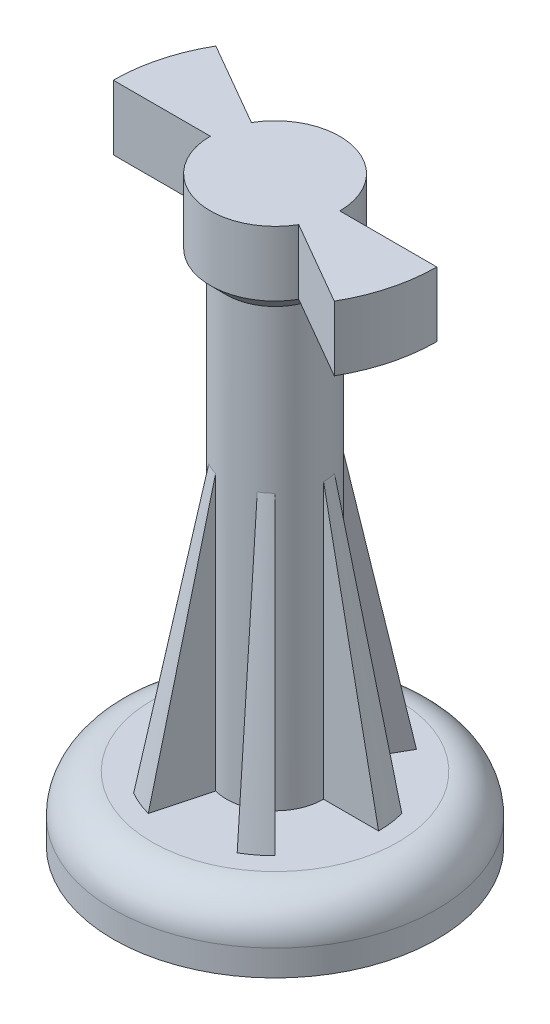
ISO-10303-21;
HEADER;
FILE_DESCRIPTION(('STEP AP214'),'2;1');
FILE_NAME('part.step','',(''),(''),'','','');
FILE_SCHEMA(('AUTOMOTIVE_DESIGN { 1 0 10303 214 1 1 1 1 }'));
ENDSEC;
DATA;
#1=APPLICATION_CONTEXT('core data for automotive mechanical design processes');
#2=APPLICATION_PROTOCOL_DEFINITION('international standard','automotive_design',2000,#1);
#3=PRODUCT_CONTEXT('',#1,'mechanical');
#4=PRODUCT('Part','Part','',(#3));
#5=PRODUCT_RELATED_PRODUCT_CATEGORY('part','',(#4));
#6=PRODUCT_DEFINITION_FORMATION('','',#4);
#7=PRODUCT_DEFINITION_CONTEXT('part definition',#1,'design');
#8=PRODUCT_DEFINITION('design','',#6,#7);
#9=PRODUCT_DEFINITION_SHAPE('','',#8);
#10=(LENGTH_UNIT() NAMED_UNIT(*) SI_UNIT(.MILLI.,.METRE.));
#11=(NAMED_UNIT(*) PLANE_ANGLE_UNIT() SI_UNIT($,.RADIAN.));
#12=(NAMED_UNIT(*) SI_UNIT($,.STERADIAN.) SOLID_ANGLE_UNIT());
#13=UNCERTAINTY_MEASURE_WITH_UNIT(LENGTH_MEASURE(1.E-05),#10,'distance_accuracy_value','');
#14=(GEOMETRIC_REPRESENTATION_CONTEXT(3) GLOBAL_UNCERTAINTY_ASSIGNED_CONTEXT((#13)) GLOBAL_UNIT_ASSIGNED_CONTEXT((#10,
#11,#12)) REPRESENTATION_CONTEXT('',''));
#15=CARTESIAN_POINT('',(0.,0.,0.));
#16=DIRECTION('',(0.,0.,1.));
#17=DIRECTION('',(1.,0.,0.));
#18=AXIS2_PLACEMENT_3D('',#15,#16,#17);
#19=CARTESIAN_POINT('',(0.,45.,0.));
#20=DIRECTION('',(0.,-1.,0.));
#21=DIRECTION('',(0.,0.,-1.));
#22=AXIS2_PLACEMENT_3D('',#19,#20,#21);
#23=CYLINDRICAL_SURFACE('',#22,3.75);
#24=CARTESIAN_POINT('',(0.,26.25,0.));
#25=DIRECTION('',(0.,-1.,0.));
#26=DIRECTION('',(0.,0.,-1.));
#27=AXIS2_PLACEMENT_3D('',#24,#25,#26);
#28=CIRCLE('',#27,3.75);
#29=CARTESIAN_POINT('',(1.87500000000004,26.25,3.24759526419162));
#30=VERTEX_POINT('',#29);
#31=CARTESIAN_POINT('',(2.65165042944959,26.25,2.65165042944952));
#32=VERTEX_POINT('',#31);
#33=EDGE_CURVE('E296',#30,#32,#28,.F.);
#34=ORIENTED_EDGE('',*,*,#33,.T.);
#35=DIRECTION('',(0.,-1.,0.));
#36=VECTOR('',#35,1.);
#37=CARTESIAN_POINT('',(2.65165042944959,45.,2.65165042944952));
#38=LINE('',#37,#36);
#39=CARTESIAN_POINT('',(2.65165042944959,5.,2.65165042944952));
#40=VERTEX_POINT('',#39);
#41=EDGE_CURVE('E424',#32,#40,#38,.T.);
#42=ORIENTED_EDGE('',*,*,#41,.T.);
#43=CARTESIAN_POINT('',(0.,5.,0.));
#44=DIRECTION('',(0.,1.,0.));
#45=DIRECTION('',(0.,0.,1.));
#46=AXIS2_PLACEMENT_3D('',#43,#44,#45);
#47=CIRCLE('',#46,3.75);
#48=CARTESIAN_POINT('',(3.75,5.,0.));
#49=VERTEX_POINT('',#48);
#50=EDGE_CURVE('E284',#40,#49,#47,.T.);
#51=ORIENTED_EDGE('',*,*,#50,.T.);
#52=DIRECTION('',(0.,-1.,0.));
#53=VECTOR('',#52,1.);
#54=CARTESIAN_POINT('',(3.75,45.,0.));
#55=LINE('',#54,#53);
#56=CARTESIAN_POINT('',(3.75,26.25,0.));
#57=VERTEX_POINT('',#56);
#58=EDGE_CURVE('E510',#57,#49,#55,.T.);
#59=ORIENTED_EDGE('',*,*,#58,.F.);
#60=CARTESIAN_POINT('',(0.,26.25,0.));
#61=DIRECTION('',(0.,-1.,0.));
#62=DIRECTION('',(0.,0.,-1.));
#63=AXIS2_PLACEMENT_3D('',#60,#61,#62);
#64=CIRCLE('',#63,3.75);
#65=CARTESIAN_POINT('',(3.62222184858401,26.25,-0.970571419134455));
#66=VERTEX_POINT('',#65);
#67=EDGE_CURVE('E282',#57,#66,#64,.F.);
#68=ORIENTED_EDGE('',*,*,#67,.T.);
#69=DIRECTION('',(0.,-1.,0.));
#70=VECTOR('',#69,1.);
#71=CARTESIAN_POINT('',(3.62222184858401,45.,-0.970571419134455));
#72=LINE('',#71,#70);
#73=CARTESIAN_POINT('',(3.62222184858401,5.,-0.970571419134455));
#74=VERTEX_POINT('',#73);
#75=EDGE_CURVE('E261',#66,#74,#72,.T.);
#76=ORIENTED_EDGE('',*,*,#75,.T.);
#77=CARTESIAN_POINT('',(1.87499999999999,5.,-3.24759526419165));
#78=VERTEX_POINT('',#77);
#79=EDGE_CURVE('E280',#74,#78,#47,.T.);
#80=ORIENTED_EDGE('',*,*,#79,.T.);
#81=DIRECTION('',(0.,-1.,0.));
#82=VECTOR('',#81,1.);
#83=CARTESIAN_POINT('',(1.87499999999999,45.,-3.24759526419165));
#84=LINE('',#83,#82);
#85=CARTESIAN_POINT('',(1.87499999999999,26.25,-3.24759526419165));
#86=VERTEX_POINT('',#85);
#87=EDGE_CURVE('E493',#86,#78,#84,.T.);
#88=ORIENTED_EDGE('',*,*,#87,.F.);
#89=CARTESIAN_POINT('',(0.,26.25,0.));
#90=DIRECTION('',(0.,-1.,0.));
#91=DIRECTION('',(0.,0.,-1.));
#92=AXIS2_PLACEMENT_3D('',#89,#90,#91);
#93=CIRCLE('',#92,3.75);
#94=CARTESIAN_POINT('',(0.970571419134442,26.25,-3.62222184858401));
#95=VERTEX_POINT('',#94);
#96=EDGE_CURVE('E288',#86,#95,#93,.F.);
#97=ORIENTED_EDGE('',*,*,#96,.T.);
#98=DIRECTION('',(0.,-1.,0.));
#99=VECTOR('',#98,1.);
#100=CARTESIAN_POINT('',(0.970571419134442,45.,-3.62222184858401));
#101=LINE('',#100,#99);
#102=CARTESIAN_POINT('',(0.970571419134442,5.,-3.62222184858401));
#103=VERTEX_POINT('',#102);
#104=EDGE_CURVE('E496',#95,#103,#101,.T.);
#105=ORIENTED_EDGE('',*,*,#104,.T.);
#106=CARTESIAN_POINT('',(-1.87500000000001,5.,-3.24759526419164));
#107=VERTEX_POINT('',#106);
#108=EDGE_CURVE('E283',#103,#107,#47,.T.);
#109=ORIENTED_EDGE('',*,*,#108,.T.);
#110=DIRECTION('',(0.,-1.,0.));
#111=VECTOR('',#110,1.);
#112=CARTESIAN_POINT('',(-1.87500000000002,45.,-3.24759526419164));
#113=LINE('',#112,#111);
#114=CARTESIAN_POINT('',(-1.87500000000002,26.25,-3.24759526419164));
#115=VERTEX_POINT('',#114);
#116=EDGE_CURVE('E475',#115,#107,#113,.T.);
#117=ORIENTED_EDGE('',*,*,#116,.F.);
#118=CARTESIAN_POINT('',(0.,26.25,0.));
#119=DIRECTION('',(0.,-1.,0.));
#120=DIRECTION('',(0.,0.,-1.));
#121=AXIS2_PLACEMENT_3D('',#118,#119,#120);
#122=CIRCLE('',#121,3.75);
#123=CARTESIAN_POINT('',(-2.65165042944957,26.25,-2.65165042944954));
#124=VERTEX_POINT('',#123);
#125=EDGE_CURVE('E290',#115,#124,#122,.F.);
#126=ORIENTED_EDGE('',*,*,#125,.T.);
#127=DIRECTION('',(0.,-1.,0.));
#128=VECTOR('',#127,1.);
#129=CARTESIAN_POINT('',(-2.65165042944957,45.,-2.65165042944954));
#130=LINE('',#129,#128);
#131=CARTESIAN_POINT('',(-2.65165042944957,5.,-2.65165042944954));
#132=VERTEX_POINT('',#131);
#133=EDGE_CURVE('E478',#124,#132,#130,.T.);
#134=ORIENTED_EDGE('',*,*,#133,.T.);
#135=CARTESIAN_POINT('',(-3.75,5.,0.));
#136=VERTEX_POINT('',#135);
#137=EDGE_CURVE('E884',#132,#136,#47,.T.);
#138=ORIENTED_EDGE('',*,*,#137,.T.);
#139=DIRECTION('',(0.,-1.,0.));
#140=VECTOR('',#139,1.);
#141=CARTESIAN_POINT('',(-3.75,45.,0.));
#142=LINE('',#141,#140);
#143=CARTESIAN_POINT('',(-3.75,26.25,0.));
#144=VERTEX_POINT('',#143);
#145=EDGE_CURVE('E457',#144,#136,#142,.T.);
#146=ORIENTED_EDGE('',*,*,#145,.F.);
#147=CARTESIAN_POINT('',(0.,26.25,0.));
#148=DIRECTION('',(0.,-1.,0.));
#149=DIRECTION('',(0.,0.,-1.));
#150=AXIS2_PLACEMENT_3D('',#147,#148,#149);
#151=CIRCLE('',#150,3.75);
#152=CARTESIAN_POINT('',(-3.62222184858401,26.25,0.970571419134455));
#153=VERTEX_POINT('',#152);
#154=EDGE_CURVE('E292',#144,#153,#151,.F.);
#155=ORIENTED_EDGE('',*,*,#154,.T.);
#156=DIRECTION('',(0.,-1.,0.));
#157=VECTOR('',#156,1.);
#158=CARTESIAN_POINT('',(-3.62222184858401,45.,0.970571419134455));
#159=LINE('',#158,#157);
#160=CARTESIAN_POINT('',(-3.62222184858401,5.,0.970571419134455));
#161=VERTEX_POINT('',#160);
#162=EDGE_CURVE('E460',#153,#161,#159,.T.);
#163=ORIENTED_EDGE('',*,*,#162,.T.);
#164=CARTESIAN_POINT('',(-1.87499999999997,5.,3.24759526419166));
#165=VERTEX_POINT('',#164);
#166=EDGE_CURVE('E883',#161,#165,#47,.T.);
#167=ORIENTED_EDGE('',*,*,#166,.T.);
#168=DIRECTION('',(0.,-1.,0.));
#169=VECTOR('',#168,1.);
#170=CARTESIAN_POINT('',(-1.87499999999997,45.,3.24759526419166));
#171=LINE('',#170,#169);
#172=CARTESIAN_POINT('',(-1.87499999999997,26.25,3.24759526419166));
#173=VERTEX_POINT('',#172);
#174=EDGE_CURVE('E439',#173,#165,#171,.T.);
#175=ORIENTED_EDGE('',*,*,#174,.F.);
#176=CARTESIAN_POINT('',(0.,26.25,0.));
#177=DIRECTION('',(0.,-1.,0.));
#178=DIRECTION('',(0.,0.,-1.));
#179=AXIS2_PLACEMENT_3D('',#176,#177,#178);
#180=CIRCLE('',#179,3.75);
#181=CARTESIAN_POINT('',(-0.970571419134417,26.25,3.62222184858402));
#182=VERTEX_POINT('',#181);
#183=EDGE_CURVE('E294',#173,#182,#180,.F.);
#184=ORIENTED_EDGE('',*,*,#183,.T.);
#185=DIRECTION('',(0.,-1.,0.));
#186=VECTOR('',#185,1.);
#187=CARTESIAN_POINT('',(-0.970571419134417,45.,3.62222184858402));
#188=LINE('',#187,#186);
#189=CARTESIAN_POINT('',(-0.970571419134417,5.,3.62222184858402));
#190=VERTEX_POINT('',#189);
#191=EDGE_CURVE('E442',#182,#190,#188,.T.);
#192=ORIENTED_EDGE('',*,*,#191,.T.);
#193=CARTESIAN_POINT('',(1.87500000000004,5.,3.24759526419162));
#194=VERTEX_POINT('',#193);
#195=EDGE_CURVE('E880',#190,#194,#47,.T.);
#196=ORIENTED_EDGE('',*,*,#195,.T.);
#197=DIRECTION('',(0.,-1.,0.));
#198=VECTOR('',#197,1.);
#199=CARTESIAN_POINT('',(1.87500000000004,45.,3.24759526419162));
#200=LINE('',#199,#198);
#201=EDGE_CURVE('E421',#30,#194,#200,.T.);
#202=ORIENTED_EDGE('',*,*,#201,.F.);
#203=EDGE_LOOP('',(#34,#42,#51,#59,#68,#76,#80,#88,#97,#105,#109,#117,#126,#134,#138,#146,#155,
#163,#167,#175,#184,#192,#196,#202));
#204=FACE_BOUND('',#203,.T.);
#205=CARTESIAN_POINT('',(0.,38.75,0.));
#206=DIRECTION('',(0.,1.,0.));
#207=DIRECTION('',(0.,0.,1.));
#208=AXIS2_PLACEMENT_3D('',#205,#206,#207);
#209=CIRCLE('',#208,3.75);
#210=CARTESIAN_POINT('',(0.,38.75,3.75));
#211=VERTEX_POINT('',#210);
#212=EDGE_CURVE('E11',#211,#211,#209,.T.);
#213=ORIENTED_EDGE('',*,*,#212,.F.);
#214=EDGE_LOOP('',(#213));
#215=FACE_BOUND('',#214,.T.);
#216=ADVANCED_FACE('F37',(#204,#215),#23,.T.);
#217=CARTESIAN_POINT('',(0.,5.,0.));
#218=DIRECTION('',(0.,-1.,0.));
#219=DIRECTION('',(0.,0.,-1.));
#220=AXIS2_PLACEMENT_3D('',#217,#218,#219);
#221=CYLINDRICAL_SURFACE('',#220,12.5);
#222=CARTESIAN_POINT('',(0.,2.,0.));
#223=DIRECTION('',(0.,1.,0.));
#224=DIRECTION('',(0.,0.,1.));
#225=AXIS2_PLACEMENT_3D('',#222,#223,#224);
#226=CIRCLE('',#225,12.5);
#227=CARTESIAN_POINT('',(0.,2.,12.5));
#228=VERTEX_POINT('',#227);
#229=EDGE_CURVE('E300',#228,#228,#226,.F.);
#230=ORIENTED_EDGE('',*,*,#229,.T.);
#231=EDGE_LOOP('',(#230));
#232=FACE_BOUND('',#231,.T.);
#233=CARTESIAN_POINT('',(0.,0.,0.));
#234=DIRECTION('',(0.,1.,0.));
#235=DIRECTION('',(0.,0.,1.));
#236=AXIS2_PLACEMENT_3D('',#233,#234,#235);
#237=CIRCLE('',#236,12.5);
#238=CARTESIAN_POINT('',(0.,0.,12.5));
#239=VERTEX_POINT('',#238);
#240=EDGE_CURVE('E275',#239,#239,#237,.T.);
#241=ORIENTED_EDGE('',*,*,#240,.T.);
#242=EDGE_LOOP('',(#241));
#243=FACE_BOUND('',#242,.T.);
#244=ADVANCED_FACE('F331',(#232,#243),#221,.T.);
#245=CARTESIAN_POINT('',(0.,5.,0.));
#246=DIRECTION('',(0.,1.,0.));
#247=DIRECTION('',(0.,0.,1.));
#248=AXIS2_PLACEMENT_3D('',#245,#246,#247);
#249=PLANE('',#248);
#250=CARTESIAN_POINT('',(0.,5.,0.));
#251=DIRECTION('',(0.,1.,0.));
#252=DIRECTION('',(0.,0.,1.));
#253=AXIS2_PLACEMENT_3D('',#250,#251,#252);
#254=CIRCLE('',#253,9.5);
#255=CARTESIAN_POINT('',(0.,5.,9.5));
#256=VERTEX_POINT('',#255);
#257=EDGE_CURVE('E298',#256,#256,#254,.T.);
#258=ORIENTED_EDGE('',*,*,#257,.T.);
#259=EDGE_LOOP('',(#258));
#260=FACE_BOUND('',#259,.T.);
#261=DIRECTION('',(0.707106781186556,0.,0.707106781186539));
#262=VECTOR('',#261,1.);
#263=CARTESIAN_POINT('',(5.65685424949245,5.00000000000001,5.65685424949231));
#264=LINE('',#263,#262);
#265=CARTESIAN_POINT('',(5.65685424949245,5.,5.65685424949231));
#266=VERTEX_POINT('',#265);
#267=EDGE_CURVE('E61',#40,#266,#264,.T.);
#268=ORIENTED_EDGE('',*,*,#267,.T.);
#269=CARTESIAN_POINT('',(0.,5.00000000000001,0.));
#270=DIRECTION('',(0.,-1.,0.));
#271=DIRECTION('',(0.866025403784433,0.,-0.50000000000001));
#272=AXIS2_PLACEMENT_3D('',#269,#270,#271);
#273=CIRCLE('',#272,8.);
#274=CARTESIAN_POINT('',(4.00000000000008,5.,6.92820323027546));
#275=VERTEX_POINT('',#274);
#276=EDGE_CURVE('E419',#266,#275,#273,.T.);
#277=ORIENTED_EDGE('',*,*,#276,.T.);
#278=DIRECTION('',(0.50000000000001,0.,0.866025403784433));
#279=VECTOR('',#278,1.);
#280=CARTESIAN_POINT('',(4.00000000000008,5.00000000000001,6.92820323027546));
#281=LINE('',#280,#279);
#282=EDGE_CURVE('E392',#194,#275,#281,.T.);
#283=ORIENTED_EDGE('',*,*,#282,.F.);
#284=ORIENTED_EDGE('',*,*,#195,.F.);
#285=DIRECTION('',(-0.258819045102511,0.,0.965925826289071));
#286=VECTOR('',#285,1.);
#287=CARTESIAN_POINT('',(-2.07055236082009,5.00000000000001,7.72740661031257));
#288=LINE('',#287,#286);
#289=CARTESIAN_POINT('',(-2.07055236082009,5.,7.72740661031257));
#290=VERTEX_POINT('',#289);
#291=EDGE_CURVE('E432',#190,#290,#288,.T.);
#292=ORIENTED_EDGE('',*,*,#291,.T.);
#293=CARTESIAN_POINT('',(0.,5.00000000000001,0.));
#294=DIRECTION('',(0.,-1.,0.));
#295=DIRECTION('',(0.866025403784443,0.,0.499999999999992));
#296=AXIS2_PLACEMENT_3D('',#293,#294,#295);
#297=CIRCLE('',#296,8.);
#298=CARTESIAN_POINT('',(-3.99999999999994,5.,6.92820323027555));
#299=VERTEX_POINT('',#298);
#300=EDGE_CURVE('E437',#290,#299,#297,.T.);
#301=ORIENTED_EDGE('',*,*,#300,.T.);
#302=DIRECTION('',(-0.499999999999992,0.,0.866025403784443));
#303=VECTOR('',#302,1.);
#304=CARTESIAN_POINT('',(-3.99999999999994,5.00000000000001,6.92820323027555));
#305=LINE('',#304,#303);
#306=EDGE_CURVE('E426',#165,#299,#305,.T.);
#307=ORIENTED_EDGE('',*,*,#306,.F.);
#308=ORIENTED_EDGE('',*,*,#166,.F.);
#309=DIRECTION('',(-0.965925826289068,0.,0.258819045102521));
#310=VECTOR('',#309,1.);
#311=CARTESIAN_POINT('',(-7.72740661031254,5.00000000000001,2.07055236082017));
#312=LINE('',#311,#310);
#313=CARTESIAN_POINT('',(-7.72740661031255,5.,2.07055236082017));
#314=VERTEX_POINT('',#313);
#315=EDGE_CURVE('E450',#161,#314,#312,.T.);
#316=ORIENTED_EDGE('',*,*,#315,.T.);
#317=CARTESIAN_POINT('',(0.,5.00000000000001,0.));
#318=DIRECTION('',(0.,-1.,0.));
#319=DIRECTION('',(0.,0.,1.));
#320=AXIS2_PLACEMENT_3D('',#317,#318,#319);
#321=CIRCLE('',#320,8.);
#322=CARTESIAN_POINT('',(-8.,5.,0.));
#323=VERTEX_POINT('',#322);
#324=EDGE_CURVE('E455',#314,#323,#321,.T.);
#325=ORIENTED_EDGE('',*,*,#324,.T.);
#326=DIRECTION('',(-1.,0.,0.));
#327=VECTOR('',#326,1.);
#328=CARTESIAN_POINT('',(-8.,5.00000000000001,0.));
#329=LINE('',#328,#327);
#330=EDGE_CURVE('E444',#136,#323,#329,.T.);
#331=ORIENTED_EDGE('',*,*,#330,.F.);
#332=ORIENTED_EDGE('',*,*,#137,.F.);
#333=DIRECTION('',(-0.707106781186551,0.,-0.707106781186544));
#334=VECTOR('',#333,1.);
#335=CARTESIAN_POINT('',(-5.65685424949241,5.00000000000001,-5.65685424949235));
#336=LINE('',#335,#334);
#337=CARTESIAN_POINT('',(-5.65685424949241,5.,-5.65685424949235));
#338=VERTEX_POINT('',#337);
#339=EDGE_CURVE('E468',#132,#338,#336,.T.);
#340=ORIENTED_EDGE('',*,*,#339,.T.);
#341=CARTESIAN_POINT('',(0.,5.00000000000001,0.));
#342=DIRECTION('',(0.,-1.,0.));
#343=DIRECTION('',(-0.866025403784436,0.,0.500000000000004));
#344=AXIS2_PLACEMENT_3D('',#341,#342,#343);
#345=CIRCLE('',#344,8.);
#346=CARTESIAN_POINT('',(-4.00000000000003,5.,-6.92820323027549));
#347=VERTEX_POINT('',#346);
#348=EDGE_CURVE('E473',#338,#347,#345,.T.);
#349=ORIENTED_EDGE('',*,*,#348,.T.);
#350=DIRECTION('',(-0.500000000000004,0.,-0.866025403784436));
#351=VECTOR('',#350,1.);
#352=CARTESIAN_POINT('',(-4.00000000000003,5.00000000000001,-6.92820323027549));
#353=LINE('',#352,#351);
#354=EDGE_CURVE('E462',#107,#347,#353,.T.);
#355=ORIENTED_EDGE('',*,*,#354,.F.);
#356=ORIENTED_EDGE('',*,*,#108,.F.);
#357=DIRECTION('',(0.258819045102518,0.,-0.965925826289069));
#358=VECTOR('',#357,1.);
#359=CARTESIAN_POINT('',(2.07055236082014,5.00000000000001,-7.72740661031255));
#360=LINE('',#359,#358);
#361=CARTESIAN_POINT('',(2.07055236082014,5.,-7.72740661031255));
#362=VERTEX_POINT('',#361);
#363=EDGE_CURVE('E486',#103,#362,#360,.T.);
#364=ORIENTED_EDGE('',*,*,#363,.T.);
#365=CARTESIAN_POINT('',(0.,5.00000000000001,0.));
#366=DIRECTION('',(0.,-1.,0.));
#367=DIRECTION('',(-0.86602540378444,0.,-0.499999999999998));
#368=AXIS2_PLACEMENT_3D('',#365,#366,#367);
#369=CIRCLE('',#368,8.);
#370=CARTESIAN_POINT('',(3.99999999999998,5.,-6.92820323027552));
#371=VERTEX_POINT('',#370);
#372=EDGE_CURVE('E491',#362,#371,#369,.T.);
#373=ORIENTED_EDGE('',*,*,#372,.T.);
#374=DIRECTION('',(0.499999999999998,0.,-0.86602540378444));
#375=VECTOR('',#374,1.);
#376=CARTESIAN_POINT('',(3.99999999999998,5.00000000000001,-6.92820323027552));
#377=LINE('',#376,#375);
#378=EDGE_CURVE('E480',#78,#371,#377,.T.);
#379=ORIENTED_EDGE('',*,*,#378,.F.);
#380=ORIENTED_EDGE('',*,*,#79,.F.);
#381=DIRECTION('',(0.965925826289068,0.,-0.258819045102521));
#382=VECTOR('',#381,1.);
#383=CARTESIAN_POINT('',(7.72740661031254,5.00000000000001,-2.07055236082017));
#384=LINE('',#383,#382);
#385=CARTESIAN_POINT('',(7.72740661031255,5.,-2.07055236082017));
#386=VERTEX_POINT('',#385);
#387=EDGE_CURVE('E504',#74,#386,#384,.T.);
#388=ORIENTED_EDGE('',*,*,#387,.T.);
#389=CARTESIAN_POINT('',(0.,5.00000000000001,0.));
#390=DIRECTION('',(0.,-1.,0.));
#391=DIRECTION('',(0.,0.,-1.));
#392=AXIS2_PLACEMENT_3D('',#389,#390,#391);
#393=CIRCLE('',#392,8.);
#394=CARTESIAN_POINT('',(8.,5.,0.));
#395=VERTEX_POINT('',#394);
#396=EDGE_CURVE('E509',#386,#395,#393,.T.);
#397=ORIENTED_EDGE('',*,*,#396,.T.);
#398=DIRECTION('',(1.,0.,0.));
#399=VECTOR('',#398,1.);
#400=CARTESIAN_POINT('',(8.,5.00000000000001,0.));
#401=LINE('',#400,#399);
#402=EDGE_CURVE('E498',#49,#395,#401,.T.);
#403=ORIENTED_EDGE('',*,*,#402,.F.);
#404=ORIENTED_EDGE('',*,*,#50,.F.);
#405=EDGE_LOOP('',(#268,#277,#283,#284,#292,#301,#307,#308,#316,#325,#331,#332,#340,#349,#355,
#356,#364,#373,#379,#380,#388,#397,#403,#404));
#406=FACE_BOUND('',#405,.T.);
#407=ADVANCED_FACE('F337',(#260,#406),#249,.T.);
#408=CARTESIAN_POINT('',(0.,0.,0.));
#409=DIRECTION('',(0.,1.,0.));
#410=DIRECTION('',(0.,0.,1.));
#411=AXIS2_PLACEMENT_3D('',#408,#409,#410);
#412=PLANE('',#411);
#413=ORIENTED_EDGE('',*,*,#240,.F.);
#414=EDGE_LOOP('',(#413));
#415=FACE_BOUND('',#414,.T.);
#416=ADVANCED_FACE('F344',(#415),#412,.F.);
#417=CARTESIAN_POINT('',(0.,5.00000000000001,0.));
#418=DIRECTION('',(0.,-1.,0.));
#419=DIRECTION('',(0.,0.,-1.));
#420=AXIS2_PLACEMENT_3D('',#417,#418,#419);
#421=CONICAL_SURFACE('',#420,8.,0.197395559849881);
#422=ORIENTED_EDGE('',*,*,#67,.F.);
#423=DIRECTION('',(-0.196116135138184,0.98058067569092,0.));
#424=VECTOR('',#423,1.);
#425=CARTESIAN_POINT('',(0.,45.,0.));
#426=LINE('',#425,#424);
#427=EDGE_CURVE('E501',#395,#57,#426,.T.);
#428=ORIENTED_EDGE('',*,*,#427,.F.);
#429=ORIENTED_EDGE('',*,*,#396,.F.);
#430=DIRECTION('',(-0.189433639881969,0.98058067569092,0.0507585908256618));
#431=VECTOR('',#430,1.);
#432=CARTESIAN_POINT('',(0.,45.,0.));
#433=LINE('',#432,#431);
#434=EDGE_CURVE('E506',#386,#66,#433,.T.);
#435=ORIENTED_EDGE('',*,*,#434,.T.);
#436=EDGE_LOOP('',(#422,#428,#429,#435));
#437=FACE_BOUND('',#436,.T.);
#438=ADVANCED_FACE('F347',(#437),#421,.T.);
#439=CARTESIAN_POINT('',(0.,0.,0.));
#440=DIRECTION('',(-0.258819045102521,0.,-0.965925826289068));
#441=DIRECTION('',(-0.965925826289068,0.,0.258819045102521));
#442=AXIS2_PLACEMENT_3D('',#439,#440,#441);
#443=PLANE('',#442);
#444=ORIENTED_EDGE('',*,*,#75,.F.);
#445=ORIENTED_EDGE('',*,*,#434,.F.);
#446=ORIENTED_EDGE('',*,*,#387,.F.);
#447=EDGE_LOOP('',(#444,#445,#446));
#448=FACE_BOUND('',#447,.T.);
#449=ADVANCED_FACE('F352',(#448),#443,.T.);
#450=CARTESIAN_POINT('',(0.,0.,0.));
#451=DIRECTION('',(0.,0.,-1.));
#452=DIRECTION('',(-1.,0.,0.));
#453=AXIS2_PLACEMENT_3D('',#450,#451,#452);
#454=PLANE('',#453);
#455=ORIENTED_EDGE('',*,*,#427,.T.);
#456=ORIENTED_EDGE('',*,*,#58,.T.);
#457=ORIENTED_EDGE('',*,*,#402,.T.);
#458=EDGE_LOOP('',(#455,#456,#457));
#459=FACE_BOUND('',#458,.T.);
#460=ADVANCED_FACE('F360',(#459),#454,.F.);
#461=CARTESIAN_POINT('',(0.,5.00000000000001,0.));
#462=DIRECTION('',(0.,-1.,0.));
#463=DIRECTION('',(-0.86602540378444,0.,-0.499999999999998));
#464=AXIS2_PLACEMENT_3D('',#461,#462,#463);
#465=CONICAL_SURFACE('',#464,8.,0.197395559849881);
#466=ORIENTED_EDGE('',*,*,#96,.F.);
#467=DIRECTION('',(-0.0980580675690916,0.98058067569092,0.16984155512169));
#468=VECTOR('',#467,1.);
#469=CARTESIAN_POINT('',(0.,45.,0.));
#470=LINE('',#469,#468);
#471=EDGE_CURVE('E483',#371,#86,#470,.T.);
#472=ORIENTED_EDGE('',*,*,#471,.F.);
#473=ORIENTED_EDGE('',*,*,#372,.F.);
#474=DIRECTION('',(-0.0507585908256612,0.98058067569092,0.189433639881969));
#475=VECTOR('',#474,1.);
#476=CARTESIAN_POINT('',(0.,45.,0.));
#477=LINE('',#476,#475);
#478=EDGE_CURVE('E488',#362,#95,#477,.T.);
#479=ORIENTED_EDGE('',*,*,#478,.T.);
#480=EDGE_LOOP('',(#466,#472,#473,#479));
#481=FACE_BOUND('',#480,.T.);
#482=ADVANCED_FACE('F522',(#481),#465,.T.);
#483=CARTESIAN_POINT('',(0.,0.,0.));
#484=DIRECTION('',(-0.965925826289069,0.,-0.258819045102518));
#485=DIRECTION('',(-0.258819045102518,0.,0.965925826289069));
#486=AXIS2_PLACEMENT_3D('',#483,#484,#485);
#487=PLANE('',#486);
#488=ORIENTED_EDGE('',*,*,#104,.F.);
#489=ORIENTED_EDGE('',*,*,#478,.F.);
#490=ORIENTED_EDGE('',*,*,#363,.F.);
#491=EDGE_LOOP('',(#488,#489,#490));
#492=FACE_BOUND('',#491,.T.);
#493=ADVANCED_FACE('F526',(#492),#487,.T.);
#494=CARTESIAN_POINT('',(0.,0.,0.));
#495=DIRECTION('',(-0.86602540378444,0.,-0.499999999999998));
#496=DIRECTION('',(-0.499999999999998,0.,0.86602540378444));
#497=AXIS2_PLACEMENT_3D('',#494,#495,#496);
#498=PLANE('',#497);
#499=ORIENTED_EDGE('',*,*,#471,.T.);
#500=ORIENTED_EDGE('',*,*,#87,.T.);
#501=ORIENTED_EDGE('',*,*,#378,.T.);
#502=EDGE_LOOP('',(#499,#500,#501));
#503=FACE_BOUND('',#502,.T.);
#504=ADVANCED_FACE('F532',(#503),#498,.F.);
#505=CARTESIAN_POINT('',(0.,5.00000000000001,0.));
#506=DIRECTION('',(0.,-1.,0.));
#507=DIRECTION('',(-0.866025403784436,0.,0.500000000000004));
#508=AXIS2_PLACEMENT_3D('',#505,#506,#507);
#509=CONICAL_SURFACE('',#508,8.,0.197395559849881);
#510=ORIENTED_EDGE('',*,*,#125,.F.);
#511=DIRECTION('',(0.0980580675690928,0.98058067569092,0.169841555121689));
#512=VECTOR('',#511,1.);
#513=CARTESIAN_POINT('',(0.,45.,0.));
#514=LINE('',#513,#512);
#515=EDGE_CURVE('E465',#347,#115,#514,.T.);
#516=ORIENTED_EDGE('',*,*,#515,.F.);
#517=ORIENTED_EDGE('',*,*,#348,.F.);
#518=DIRECTION('',(0.138675049056308,0.98058067569092,0.138675049056307));
#519=VECTOR('',#518,1.);
#520=CARTESIAN_POINT('',(0.,45.,0.));
#521=LINE('',#520,#519);
#522=EDGE_CURVE('E470',#338,#124,#521,.T.);
#523=ORIENTED_EDGE('',*,*,#522,.T.);
#524=EDGE_LOOP('',(#510,#516,#517,#523));
#525=FACE_BOUND('',#524,.T.);
#526=ADVANCED_FACE('F536',(#525),#509,.T.);
#527=CARTESIAN_POINT('',(0.,0.,0.));
#528=DIRECTION('',(-0.707106781186544,0.,0.707106781186551));
#529=DIRECTION('',(0.707106781186551,0.,0.707106781186544));
#530=AXIS2_PLACEMENT_3D('',#527,#528,#529);
#531=PLANE('',#530);
#532=ORIENTED_EDGE('',*,*,#133,.F.);
#533=ORIENTED_EDGE('',*,*,#522,.F.);
#534=ORIENTED_EDGE('',*,*,#339,.F.);
#535=EDGE_LOOP('',(#532,#533,#534));
#536=FACE_BOUND('',#535,.T.);
#537=ADVANCED_FACE('F540',(#536),#531,.T.);
#538=CARTESIAN_POINT('',(0.,0.,0.));
#539=DIRECTION('',(-0.866025403784436,0.,0.500000000000004));
#540=DIRECTION('',(0.500000000000004,0.,0.866025403784436));
#541=AXIS2_PLACEMENT_3D('',#538,#539,#540);
#542=PLANE('',#541);
#543=ORIENTED_EDGE('',*,*,#515,.T.);
#544=ORIENTED_EDGE('',*,*,#116,.T.);
#545=ORIENTED_EDGE('',*,*,#354,.T.);
#546=EDGE_LOOP('',(#543,#544,#545));
#547=FACE_BOUND('',#546,.T.);
#548=ADVANCED_FACE('F544',(#547),#542,.F.);
#549=CARTESIAN_POINT('',(0.,5.00000000000001,0.));
#550=DIRECTION('',(0.,-1.,0.));
#551=DIRECTION('',(0.,0.,1.));
#552=AXIS2_PLACEMENT_3D('',#549,#550,#551);
#553=CONICAL_SURFACE('',#552,8.,0.197395559849881);
#554=ORIENTED_EDGE('',*,*,#154,.F.);
#555=DIRECTION('',(0.196116135138184,0.98058067569092,0.));
#556=VECTOR('',#555,1.);
#557=CARTESIAN_POINT('',(0.,45.,0.));
#558=LINE('',#557,#556);
#559=EDGE_CURVE('E447',#323,#144,#558,.T.);
#560=ORIENTED_EDGE('',*,*,#559,.F.);
#561=ORIENTED_EDGE('',*,*,#324,.F.);
#562=DIRECTION('',(0.189433639881969,0.98058067569092,-0.0507585908256618));
#563=VECTOR('',#562,1.);
#564=CARTESIAN_POINT('',(0.,45.,0.));
#565=LINE('',#564,#563);
#566=EDGE_CURVE('E452',#314,#153,#565,.T.);
#567=ORIENTED_EDGE('',*,*,#566,.T.);
#568=EDGE_LOOP('',(#554,#560,#561,#567));
#569=FACE_BOUND('',#568,.T.);
#570=ADVANCED_FACE('F548',(#569),#553,.T.);
#571=CARTESIAN_POINT('',(0.,0.,0.));
#572=DIRECTION('',(0.258819045102521,0.,0.965925826289068));
#573=DIRECTION('',(0.965925826289068,0.,-0.258819045102521));
#574=AXIS2_PLACEMENT_3D('',#571,#572,#573);
#575=PLANE('',#574);
#576=ORIENTED_EDGE('',*,*,#162,.F.);
#577=ORIENTED_EDGE('',*,*,#566,.F.);
#578=ORIENTED_EDGE('',*,*,#315,.F.);
#579=EDGE_LOOP('',(#576,#577,#578));
#580=FACE_BOUND('',#579,.T.);
#581=ADVANCED_FACE('F552',(#580),#575,.T.);
#582=CARTESIAN_POINT('',(0.,0.,0.));
#583=DIRECTION('',(0.,0.,1.));
#584=DIRECTION('',(1.,0.,0.));
#585=AXIS2_PLACEMENT_3D('',#582,#583,#584);
#586=PLANE('',#585);
#587=ORIENTED_EDGE('',*,*,#559,.T.);
#588=ORIENTED_EDGE('',*,*,#145,.T.);
#589=ORIENTED_EDGE('',*,*,#330,.T.);
#590=EDGE_LOOP('',(#587,#588,#589));
#591=FACE_BOUND('',#590,.T.);
#592=ADVANCED_FACE('F556',(#591),#586,.F.);
#593=CARTESIAN_POINT('',(0.,5.00000000000001,0.));
#594=DIRECTION('',(0.,-1.,0.));
#595=DIRECTION('',(0.866025403784443,0.,0.499999999999992));
#596=AXIS2_PLACEMENT_3D('',#593,#594,#595);
#597=CONICAL_SURFACE('',#596,8.,0.197395559849881);
#598=ORIENTED_EDGE('',*,*,#183,.F.);
#599=DIRECTION('',(0.0980580675690904,0.98058067569092,-0.16984155512169));
#600=VECTOR('',#599,1.);
#601=CARTESIAN_POINT('',(0.,45.,0.));
#602=LINE('',#601,#600);
#603=EDGE_CURVE('E429',#299,#173,#602,.T.);
#604=ORIENTED_EDGE('',*,*,#603,.F.);
#605=ORIENTED_EDGE('',*,*,#300,.F.);
#606=DIRECTION('',(0.0507585908256598,0.98058067569092,-0.189433639881969));
#607=VECTOR('',#606,1.);
#608=CARTESIAN_POINT('',(0.,45.,0.));
#609=LINE('',#608,#607);
#610=EDGE_CURVE('E434',#290,#182,#609,.T.);
#611=ORIENTED_EDGE('',*,*,#610,.T.);
#612=EDGE_LOOP('',(#598,#604,#605,#611));
#613=FACE_BOUND('',#612,.T.);
#614=ADVANCED_FACE('F560',(#613),#597,.T.);
#615=CARTESIAN_POINT('',(0.,0.,0.));
#616=DIRECTION('',(0.965925826289071,0.,0.258819045102511));
#617=DIRECTION('',(0.258819045102511,0.,-0.965925826289071));
#618=AXIS2_PLACEMENT_3D('',#615,#616,#617);
#619=PLANE('',#618);
#620=ORIENTED_EDGE('',*,*,#191,.F.);
#621=ORIENTED_EDGE('',*,*,#610,.F.);
#622=ORIENTED_EDGE('',*,*,#291,.F.);
#623=EDGE_LOOP('',(#620,#621,#622));
#624=FACE_BOUND('',#623,.T.);
#625=ADVANCED_FACE('F564',(#624),#619,.T.);
#626=CARTESIAN_POINT('',(0.,0.,0.));
#627=DIRECTION('',(0.866025403784443,0.,0.499999999999992));
#628=DIRECTION('',(0.499999999999992,0.,-0.866025403784443));
#629=AXIS2_PLACEMENT_3D('',#626,#627,#628);
#630=PLANE('',#629);
#631=ORIENTED_EDGE('',*,*,#603,.T.);
#632=ORIENTED_EDGE('',*,*,#174,.T.);
#633=ORIENTED_EDGE('',*,*,#306,.T.);
#634=EDGE_LOOP('',(#631,#632,#633));
#635=FACE_BOUND('',#634,.T.);
#636=ADVANCED_FACE('F568',(#635),#630,.F.);
#637=CARTESIAN_POINT('',(0.,5.00000000000001,0.));
#638=DIRECTION('',(0.,-1.,0.));
#639=DIRECTION('',(0.866025403784433,0.,-0.50000000000001));
#640=AXIS2_PLACEMENT_3D('',#637,#638,#639);
#641=CONICAL_SURFACE('',#640,8.,0.197395559849881);
#642=ORIENTED_EDGE('',*,*,#33,.F.);
#643=DIRECTION('',(-0.098058067569094,0.98058067569092,-0.169841555121688));
#644=VECTOR('',#643,1.);
#645=CARTESIAN_POINT('',(0.,45.,0.));
#646=LINE('',#645,#644);
#647=EDGE_CURVE('E412',#275,#30,#646,.T.);
#648=ORIENTED_EDGE('',*,*,#647,.F.);
#649=ORIENTED_EDGE('',*,*,#276,.F.);
#650=DIRECTION('',(-0.138675049056309,0.98058067569092,-0.138675049056306));
#651=VECTOR('',#650,1.);
#652=CARTESIAN_POINT('',(0.,45.,0.));
#653=LINE('',#652,#651);
#654=EDGE_CURVE('E416',#266,#32,#653,.T.);
#655=ORIENTED_EDGE('',*,*,#654,.T.);
#656=EDGE_LOOP('',(#642,#648,#649,#655));
#657=FACE_BOUND('',#656,.T.);
#658=ADVANCED_FACE('F572',(#657),#641,.T.);
#659=CARTESIAN_POINT('',(0.,0.,0.));
#660=DIRECTION('',(0.707106781186539,0.,-0.707106781186556));
#661=DIRECTION('',(-0.707106781186556,0.,-0.707106781186539));
#662=AXIS2_PLACEMENT_3D('',#659,#660,#661);
#663=PLANE('',#662);
#664=ORIENTED_EDGE('',*,*,#41,.F.);
#665=ORIENTED_EDGE('',*,*,#654,.F.);
#666=ORIENTED_EDGE('',*,*,#267,.F.);
#667=EDGE_LOOP('',(#664,#665,#666));
#668=FACE_BOUND('',#667,.T.);
#669=ADVANCED_FACE('F576',(#668),#663,.T.);
#670=CARTESIAN_POINT('',(0.,0.,0.));
#671=DIRECTION('',(0.866025403784433,0.,-0.50000000000001));
#672=DIRECTION('',(-0.50000000000001,0.,-0.866025403784433));
#673=AXIS2_PLACEMENT_3D('',#670,#671,#672);
#674=PLANE('',#673);
#675=ORIENTED_EDGE('',*,*,#647,.T.);
#676=ORIENTED_EDGE('',*,*,#201,.T.);
#677=ORIENTED_EDGE('',*,*,#282,.T.);
#678=EDGE_LOOP('',(#675,#676,#677));
#679=FACE_BOUND('',#678,.T.);
#680=ADVANCED_FACE('F580',(#679),#674,.F.);
#681=CARTESIAN_POINT('',(0.,2.,0.));
#682=DIRECTION('',(0.,1.,0.));
#683=DIRECTION('',(0.,0.,1.));
#684=AXIS2_PLACEMENT_3D('',#681,#682,#683);
#685=TOROIDAL_SURFACE('',#684,9.5,3.);
#686=ORIENTED_EDGE('',*,*,#229,.F.);
#687=EDGE_LOOP('',(#686));
#688=FACE_BOUND('',#687,.T.);
#689=ORIENTED_EDGE('',*,*,#257,.F.);
#690=EDGE_LOOP('',(#689));
#691=FACE_BOUND('',#690,.T.);
#692=ADVANCED_FACE('F39',(#688,#691),#685,.T.);
#693=CARTESIAN_POINT('',(0.,40.,0.));
#694=DIRECTION('',(0.,1.,0.));
#695=DIRECTION('',(0.,0.,-1.));
#696=AXIS2_PLACEMENT_3D('',#693,#694,#695);
#697=CONICAL_SURFACE('',#696,5.,0.78539816339745);
#698=CARTESIAN_POINT('',(0.,40.,0.));
#699=DIRECTION('',(0.,-1.,0.));
#700=DIRECTION('',(0.,0.,-1.));
#701=AXIS2_PLACEMENT_3D('',#698,#699,#700);
#702=CIRCLE('',#701,5.);
#703=CARTESIAN_POINT('',(5.,40.,0.));
#704=VERTEX_POINT('',#703);
#705=CARTESIAN_POINT('',(4.33012701892219,40.,2.50000000000001));
#706=VERTEX_POINT('',#705);
#707=EDGE_CURVE('E218',#704,#706,#702,.T.);
#708=ORIENTED_EDGE('',*,*,#707,.T.);
#709=CARTESIAN_POINT('',(0.,40.,0.));
#710=DIRECTION('',(0.,1.,0.));
#711=DIRECTION('',(0.,0.,1.));
#712=AXIS2_PLACEMENT_3D('',#709,#710,#711);
#713=CIRCLE('',#712,5.);
#714=CARTESIAN_POINT('',(-5.,40.,0.));
#715=VERTEX_POINT('',#714);
#716=EDGE_CURVE('E226',#715,#706,#713,.T.);
#717=ORIENTED_EDGE('',*,*,#716,.F.);
#718=CARTESIAN_POINT('',(-4.33012701892219,40.,-2.50000000000001));
#719=VERTEX_POINT('',#718);
#720=EDGE_CURVE('E221',#715,#719,#702,.T.);
#721=ORIENTED_EDGE('',*,*,#720,.T.);
#722=EDGE_CURVE('E214',#704,#719,#713,.T.);
#723=ORIENTED_EDGE('',*,*,#722,.F.);
#724=EDGE_LOOP('',(#708,#717,#721,#723));
#725=FACE_BOUND('',#724,.T.);
#726=ORIENTED_EDGE('',*,*,#212,.T.);
#727=EDGE_LOOP('',(#726));
#728=FACE_BOUND('',#727,.T.);
#729=ADVANCED_FACE('F216',(#725,#728),#697,.T.);
#730=CARTESIAN_POINT('',(0.,40.,0.));
#731=DIRECTION('',(0.,1.,0.));
#732=DIRECTION('',(0.,0.,1.));
#733=AXIS2_PLACEMENT_3D('',#730,#731,#732);
#734=CYLINDRICAL_SURFACE('',#733,12.5);
#735=CARTESIAN_POINT('',(0.,45.,0.));
#736=DIRECTION('',(0.,1.,0.));
#737=DIRECTION('',(0.,0.,1.));
#738=AXIS2_PLACEMENT_3D('',#735,#736,#737);
#739=CIRCLE('',#738,12.5);
#740=CARTESIAN_POINT('',(-10.8253175473055,45.,-6.25000000000001));
#741=VERTEX_POINT('',#740);
#742=CARTESIAN_POINT('',(-12.5,45.,0.));
#743=VERTEX_POINT('',#742);
#744=EDGE_CURVE('E260',#741,#743,#739,.T.);
#745=ORIENTED_EDGE('',*,*,#744,.F.);
#746=DIRECTION('',(0.,1.,0.));
#747=VECTOR('',#746,1.);
#748=CARTESIAN_POINT('',(-10.8253175473055,40.,-6.25000000000001));
#749=LINE('',#748,#747);
#750=CARTESIAN_POINT('',(-10.8253175473055,40.,-6.25000000000001));
#751=VERTEX_POINT('',#750);
#752=EDGE_CURVE('E249',#751,#741,#749,.T.);
#753=ORIENTED_EDGE('',*,*,#752,.F.);
#754=CARTESIAN_POINT('',(0.,40.,0.));
#755=DIRECTION('',(0.,1.,0.));
#756=DIRECTION('',(0.,0.,1.));
#757=AXIS2_PLACEMENT_3D('',#754,#755,#756);
#758=CIRCLE('',#757,12.5);
#759=CARTESIAN_POINT('',(-12.5,40.,0.));
#760=VERTEX_POINT('',#759);
#761=EDGE_CURVE('E397',#751,#760,#758,.T.);
#762=ORIENTED_EDGE('',*,*,#761,.T.);
#763=DIRECTION('',(0.,1.,0.));
#764=VECTOR('',#763,1.);
#765=CARTESIAN_POINT('',(-12.5,40.,0.));
#766=LINE('',#765,#764);
#767=EDGE_CURVE('E253',#760,#743,#766,.T.);
#768=ORIENTED_EDGE('',*,*,#767,.T.);
#769=EDGE_LOOP('',(#745,#753,#762,#768));
#770=FACE_BOUND('',#769,.T.);
#771=ADVANCED_FACE('F319',(#770),#734,.T.);
#772=CARTESIAN_POINT('',(0.,40.,0.));
#773=DIRECTION('',(0.,1.,0.));
#774=DIRECTION('',(0.,0.,1.));
#775=AXIS2_PLACEMENT_3D('',#772,#773,#774);
#776=CYLINDRICAL_SURFACE('',#775,12.5);
#777=CARTESIAN_POINT('',(0.,45.,0.));
#778=DIRECTION('',(0.,1.,0.));
#779=DIRECTION('',(0.,0.,1.));
#780=AXIS2_PLACEMENT_3D('',#777,#778,#779);
#781=CIRCLE('',#780,12.5);
#782=CARTESIAN_POINT('',(10.8253175473055,45.,6.25000000000001));
#783=VERTEX_POINT('',#782);
#784=CARTESIAN_POINT('',(12.5,45.,0.));
#785=VERTEX_POINT('',#784);
#786=EDGE_CURVE('E268',#783,#785,#781,.T.);
#787=ORIENTED_EDGE('',*,*,#786,.F.);
#788=DIRECTION('',(0.,1.,0.));
#789=VECTOR('',#788,1.);
#790=CARTESIAN_POINT('',(10.8253175473055,40.,6.25000000000001));
#791=LINE('',#790,#789);
#792=CARTESIAN_POINT('',(10.8253175473055,40.,6.25000000000001));
#793=VERTEX_POINT('',#792);
#794=EDGE_CURVE('E276',#793,#783,#791,.T.);
#795=ORIENTED_EDGE('',*,*,#794,.F.);
#796=CARTESIAN_POINT('',(0.,40.,0.));
#797=DIRECTION('',(0.,1.,0.));
#798=DIRECTION('',(0.,0.,1.));
#799=AXIS2_PLACEMENT_3D('',#796,#797,#798);
#800=CIRCLE('',#799,12.5);
#801=CARTESIAN_POINT('',(12.5,40.,0.));
#802=VERTEX_POINT('',#801);
#803=EDGE_CURVE('E250',#793,#802,#800,.T.);
#804=ORIENTED_EDGE('',*,*,#803,.T.);
#805=DIRECTION('',(0.,1.,0.));
#806=VECTOR('',#805,1.);
#807=CARTESIAN_POINT('',(12.5,40.,0.));
#808=LINE('',#807,#806);
#809=EDGE_CURVE('E247',#802,#785,#808,.T.);
#810=ORIENTED_EDGE('',*,*,#809,.T.);
#811=EDGE_LOOP('',(#787,#795,#804,#810));
#812=FACE_BOUND('',#811,.T.);
#813=ADVANCED_FACE('F317',(#812),#776,.T.);
#814=CARTESIAN_POINT('',(3.24759526419164,40.,1.875));
#815=DIRECTION('',(-0.500000000000001,0.,0.866025403784438));
#816=DIRECTION('',(0.866025403784438,0.,0.500000000000001));
#817=AXIS2_PLACEMENT_3D('',#814,#815,#816);
#818=PLANE('',#817);
#819=DIRECTION('',(0.,1.,0.));
#820=VECTOR('',#819,1.);
#821=CARTESIAN_POINT('',(4.33012701892219,40.,2.50000000000001));
#822=LINE('',#821,#820);
#823=CARTESIAN_POINT('',(4.33012701892219,45.,2.50000000000001));
#824=VERTEX_POINT('',#823);
#825=EDGE_CURVE('E41',#706,#824,#822,.T.);
#826=ORIENTED_EDGE('',*,*,#825,.F.);
#827=DIRECTION('',(0.866025403784438,0.,0.500000000000001));
#828=VECTOR('',#827,1.);
#829=CARTESIAN_POINT('',(3.24759526419164,40.,1.875));
#830=LINE('',#829,#828);
#831=EDGE_CURVE('E235',#706,#793,#830,.T.);
#832=ORIENTED_EDGE('',*,*,#831,.T.);
#833=ORIENTED_EDGE('',*,*,#794,.T.);
#834=DIRECTION('',(0.866025403784438,0.,0.500000000000001));
#835=VECTOR('',#834,1.);
#836=CARTESIAN_POINT('',(3.24759526419164,45.,1.875));
#837=LINE('',#836,#835);
#838=EDGE_CURVE('E266',#824,#783,#837,.T.);
#839=ORIENTED_EDGE('',*,*,#838,.F.);
#840=EDGE_LOOP('',(#826,#832,#833,#839));
#841=FACE_BOUND('',#840,.T.);
#842=ADVANCED_FACE('F311',(#841),#818,.T.);
#843=CARTESIAN_POINT('',(-3.75,40.,0.));
#844=DIRECTION('',(0.,0.,1.));
#845=DIRECTION('',(1.,0.,0.));
#846=AXIS2_PLACEMENT_3D('',#843,#844,#845);
#847=PLANE('',#846);
#848=DIRECTION('',(0.,1.,0.));
#849=VECTOR('',#848,1.);
#850=CARTESIAN_POINT('',(-5.,40.,0.));
#851=LINE('',#850,#849);
#852=CARTESIAN_POINT('',(-5.,45.,0.));
#853=VERTEX_POINT('',#852);
#854=EDGE_CURVE('E244',#853,#715,#851,.F.);
#855=ORIENTED_EDGE('',*,*,#854,.F.);
#856=DIRECTION('',(1.,0.,0.));
#857=VECTOR('',#856,1.);
#858=CARTESIAN_POINT('',(-3.75,45.,0.));
#859=LINE('',#858,#857);
#860=EDGE_CURVE('E264',#743,#853,#859,.T.);
#861=ORIENTED_EDGE('',*,*,#860,.F.);
#862=ORIENTED_EDGE('',*,*,#767,.F.);
#863=DIRECTION('',(1.,0.,0.));
#864=VECTOR('',#863,1.);
#865=CARTESIAN_POINT('',(-3.75,40.,0.));
#866=LINE('',#865,#864);
#867=EDGE_CURVE('E399',#760,#715,#866,.T.);
#868=ORIENTED_EDGE('',*,*,#867,.T.);
#869=EDGE_LOOP('',(#855,#861,#862,#868));
#870=FACE_BOUND('',#869,.T.);
#871=ADVANCED_FACE('F325',(#870),#847,.T.);
#872=CARTESIAN_POINT('',(0.,40.,0.));
#873=DIRECTION('',(0.,1.,0.));
#874=DIRECTION('',(0.,0.,1.));
#875=AXIS2_PLACEMENT_3D('',#872,#873,#874);
#876=PLANE('',#875);
#877=ORIENTED_EDGE('',*,*,#707,.F.);
#878=DIRECTION('',(-1.,0.,0.));
#879=VECTOR('',#878,1.);
#880=CARTESIAN_POINT('',(3.75,40.,0.));
#881=LINE('',#880,#879);
#882=EDGE_CURVE('E234',#802,#704,#881,.T.);
#883=ORIENTED_EDGE('',*,*,#882,.F.);
#884=ORIENTED_EDGE('',*,*,#803,.F.);
#885=ORIENTED_EDGE('',*,*,#831,.F.);
#886=EDGE_LOOP('',(#877,#883,#884,#885));
#887=FACE_BOUND('',#886,.T.);
#888=ADVANCED_FACE('F231',(#887),#876,.F.);
#889=CARTESIAN_POINT('',(3.75,40.,0.));
#890=DIRECTION('',(0.,0.,-1.));
#891=DIRECTION('',(-1.,0.,0.));
#892=AXIS2_PLACEMENT_3D('',#889,#890,#891);
#893=PLANE('',#892);
#894=DIRECTION('',(0.,1.,0.));
#895=VECTOR('',#894,1.);
#896=CARTESIAN_POINT('',(5.,40.,0.));
#897=LINE('',#896,#895);
#898=CARTESIAN_POINT('',(5.,45.,0.));
#899=VERTEX_POINT('',#898);
#900=EDGE_CURVE('E225',#899,#704,#897,.F.);
#901=ORIENTED_EDGE('',*,*,#900,.F.);
#902=DIRECTION('',(-1.,0.,0.));
#903=VECTOR('',#902,1.);
#904=CARTESIAN_POINT('',(3.75,45.,0.));
#905=LINE('',#904,#903);
#906=EDGE_CURVE('E271',#785,#899,#905,.T.);
#907=ORIENTED_EDGE('',*,*,#906,.F.);
#908=ORIENTED_EDGE('',*,*,#809,.F.);
#909=ORIENTED_EDGE('',*,*,#882,.T.);
#910=EDGE_LOOP('',(#901,#907,#908,#909));
#911=FACE_BOUND('',#910,.T.);
#912=ADVANCED_FACE('F246',(#911),#893,.T.);
#913=CARTESIAN_POINT('',(0.,40.,0.));
#914=DIRECTION('',(0.,1.,0.));
#915=DIRECTION('',(0.,0.,1.));
#916=AXIS2_PLACEMENT_3D('',#913,#914,#915);
#917=CYLINDRICAL_SURFACE('',#916,5.);
#918=CARTESIAN_POINT('',(0.,45.,0.));
#919=DIRECTION('',(0.,1.,0.));
#920=DIRECTION('',(0.,0.,1.));
#921=AXIS2_PLACEMENT_3D('',#918,#919,#920);
#922=CIRCLE('',#921,5.);
#923=EDGE_CURVE('E53',#853,#824,#922,.T.);
#924=ORIENTED_EDGE('',*,*,#923,.F.);
#925=ORIENTED_EDGE('',*,*,#854,.T.);
#926=ORIENTED_EDGE('',*,*,#716,.T.);
#927=ORIENTED_EDGE('',*,*,#825,.T.);
#928=EDGE_LOOP('',(#924,#925,#926,#927));
#929=FACE_BOUND('',#928,.T.);
#930=ADVANCED_FACE('F307',(#929),#917,.T.);
#931=CARTESIAN_POINT('',(0.,45.,0.));
#932=DIRECTION('',(0.,1.,0.));
#933=DIRECTION('',(0.,0.,1.));
#934=AXIS2_PLACEMENT_3D('',#931,#932,#933);
#935=PLANE('',#934);
#936=ORIENTED_EDGE('',*,*,#860,.T.);
#937=ORIENTED_EDGE('',*,*,#923,.T.);
#938=ORIENTED_EDGE('',*,*,#838,.T.);
#939=ORIENTED_EDGE('',*,*,#786,.T.);
#940=ORIENTED_EDGE('',*,*,#906,.T.);
#941=CARTESIAN_POINT('',(-4.33012701892219,45.,-2.50000000000001));
#942=VERTEX_POINT('',#941);
#943=EDGE_CURVE('E240',#899,#942,#922,.T.);
#944=ORIENTED_EDGE('',*,*,#943,.T.);
#945=DIRECTION('',(-0.866025403784438,0.,-0.500000000000001));
#946=VECTOR('',#945,1.);
#947=CARTESIAN_POINT('',(-3.24759526419164,45.,-1.875));
#948=LINE('',#947,#946);
#949=EDGE_CURVE('E258',#942,#741,#948,.T.);
#950=ORIENTED_EDGE('',*,*,#949,.T.);
#951=ORIENTED_EDGE('',*,*,#744,.T.);
#952=EDGE_LOOP('',(#936,#937,#938,#939,#940,#944,#950,#951));
#953=FACE_BOUND('',#952,.T.);
#954=CARTESIAN_POINT('',(0.,45.,0.));
#955=VERTEX_POINT('',#954);
#956=VERTEX_LOOP('',#955);
#957=FACE_BOUND('',#956,.T.);
#958=ADVANCED_FACE('F314',(#953,#957),#935,.T.);
#959=ORIENTED_EDGE('',*,*,#720,.F.);
#960=ORIENTED_EDGE('',*,*,#867,.F.);
#961=ORIENTED_EDGE('',*,*,#761,.F.);
#962=DIRECTION('',(-0.866025403784438,0.,-0.500000000000001));
#963=VECTOR('',#962,1.);
#964=CARTESIAN_POINT('',(-3.24759526419164,40.,-1.875));
#965=LINE('',#964,#963);
#966=EDGE_CURVE('E273',#719,#751,#965,.T.);
#967=ORIENTED_EDGE('',*,*,#966,.F.);
#968=EDGE_LOOP('',(#959,#960,#961,#967));
#969=FACE_BOUND('',#968,.T.);
#970=ADVANCED_FACE('F366',(#969),#876,.F.);
#971=CARTESIAN_POINT('',(-3.24759526419164,40.,-1.875));
#972=DIRECTION('',(0.500000000000001,0.,-0.866025403784438));
#973=DIRECTION('',(-0.866025403784438,0.,-0.500000000000001));
#974=AXIS2_PLACEMENT_3D('',#971,#972,#973);
#975=PLANE('',#974);
#976=DIRECTION('',(0.,1.,0.));
#977=VECTOR('',#976,1.);
#978=CARTESIAN_POINT('',(-4.33012701892219,40.,-2.50000000000001));
#979=LINE('',#978,#977);
#980=EDGE_CURVE('E389',#719,#942,#979,.T.);
#981=ORIENTED_EDGE('',*,*,#980,.F.);
#982=ORIENTED_EDGE('',*,*,#966,.T.);
#983=ORIENTED_EDGE('',*,*,#752,.T.);
#984=ORIENTED_EDGE('',*,*,#949,.F.);
#985=EDGE_LOOP('',(#981,#982,#983,#984));
#986=FACE_BOUND('',#985,.T.);
#987=ADVANCED_FACE('F368',(#986),#975,.T.);
#988=ORIENTED_EDGE('',*,*,#722,.T.);
#989=ORIENTED_EDGE('',*,*,#980,.T.);
#990=ORIENTED_EDGE('',*,*,#943,.F.);
#991=ORIENTED_EDGE('',*,*,#900,.T.);
#992=EDGE_LOOP('',(#988,#989,#990,#991));
#993=FACE_BOUND('',#992,.T.);
#994=ADVANCED_FACE('F238',(#993),#917,.T.);
#995=CLOSED_SHELL('',(#216,#244,#407,#416,#438,#449,#460,#482,#493,#504,#526,#537,#548,#570,
#581,#592,#614,#625,#636,#658,#669,#680,#692,#729,#771,#813,#842,#871,#888,#912,#930,#958,#970,
#987,#994));
#996=MANIFOLD_SOLID_BREP('B2',#995);
#997=ADVANCED_BREP_SHAPE_REPRESENTATION('',(#18,#996),#14);
#998=SHAPE_DEFINITION_REPRESENTATION(#9,#997);
ENDSEC;
END-ISO-10303-21;
